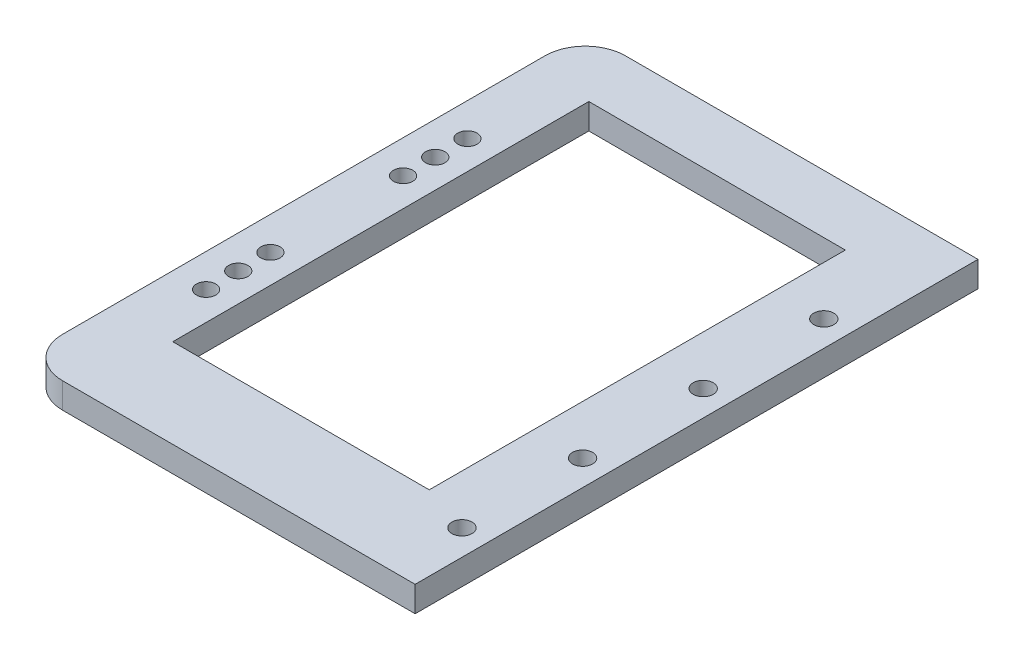
ISO-10303-21;
HEADER;
FILE_DESCRIPTION(('STEP AP214'),'2;1');
FILE_NAME('part.step','',(''),(''),'','','');
FILE_SCHEMA(('AUTOMOTIVE_DESIGN { 1 0 10303 214 1 1 1 1 }'));
ENDSEC;
DATA;
#1=APPLICATION_CONTEXT('core data for automotive mechanical design processes');
#2=APPLICATION_PROTOCOL_DEFINITION('international standard','automotive_design',2000,#1);
#3=PRODUCT_CONTEXT('',#1,'mechanical');
#4=PRODUCT('Part','Part','',(#3));
#5=PRODUCT_RELATED_PRODUCT_CATEGORY('part','',(#4));
#6=PRODUCT_DEFINITION_FORMATION('','',#4);
#7=PRODUCT_DEFINITION_CONTEXT('part definition',#1,'design');
#8=PRODUCT_DEFINITION('design','',#6,#7);
#9=PRODUCT_DEFINITION_SHAPE('','',#8);
#10=(LENGTH_UNIT() NAMED_UNIT(*) SI_UNIT(.MILLI.,.METRE.));
#11=(NAMED_UNIT(*) PLANE_ANGLE_UNIT() SI_UNIT($,.RADIAN.));
#12=(NAMED_UNIT(*) SI_UNIT($,.STERADIAN.) SOLID_ANGLE_UNIT());
#13=UNCERTAINTY_MEASURE_WITH_UNIT(LENGTH_MEASURE(1.E-05),#10,'distance_accuracy_value','');
#14=(GEOMETRIC_REPRESENTATION_CONTEXT(3) GLOBAL_UNCERTAINTY_ASSIGNED_CONTEXT((#13)) GLOBAL_UNIT_ASSIGNED_CONTEXT((#10,
#11,#12)) REPRESENTATION_CONTEXT('',''));
#15=CARTESIAN_POINT('',(0.,0.,0.));
#16=DIRECTION('',(0.,0.,1.));
#17=DIRECTION('',(1.,0.,0.));
#18=AXIS2_PLACEMENT_3D('',#15,#16,#17);
#19=CARTESIAN_POINT('',(-44.8562300319489,6.35,-77.8913738019169));
#20=DIRECTION('',(1.,0.,0.));
#21=DIRECTION('',(0.,0.,-1.));
#22=AXIS2_PLACEMENT_3D('',#19,#20,#21);
#23=PLANE('',#22);
#24=DIRECTION('',(0.,0.,1.));
#25=VECTOR('',#24,1.);
#26=CARTESIAN_POINT('',(-44.8562300319489,0.,-77.8913738019169));
#27=LINE('',#26,#25);
#28=CARTESIAN_POINT('',(-44.8562300319489,0.,-67.8913738019169));
#29=VERTEX_POINT('',#28);
#30=CARTESIAN_POINT('',(-44.8562300319489,0.,52.1086261980831));
#31=VERTEX_POINT('',#30);
#32=EDGE_CURVE('E147',#29,#31,#27,.T.);
#33=ORIENTED_EDGE('',*,*,#32,.T.);
#34=DIRECTION('',(0.,-1.,0.));
#35=VECTOR('',#34,1.);
#36=CARTESIAN_POINT('',(-44.8562300319489,6.35,52.1086261980831));
#37=LINE('',#36,#35);
#38=CARTESIAN_POINT('',(-44.8562300319489,6.35,52.1086261980831));
#39=VERTEX_POINT('',#38);
#40=EDGE_CURVE('E186',#31,#39,#37,.F.);
#41=ORIENTED_EDGE('',*,*,#40,.T.);
#42=DIRECTION('',(0.,0.,1.));
#43=VECTOR('',#42,1.);
#44=CARTESIAN_POINT('',(-44.8562300319489,6.35,-77.8913738019169));
#45=LINE('',#44,#43);
#46=CARTESIAN_POINT('',(-44.8562300319489,6.35,-67.8913738019169));
#47=VERTEX_POINT('',#46);
#48=EDGE_CURVE('E151',#47,#39,#45,.T.);
#49=ORIENTED_EDGE('',*,*,#48,.F.);
#50=DIRECTION('',(0.,-1.,0.));
#51=VECTOR('',#50,1.);
#52=CARTESIAN_POINT('',(-44.8562300319489,6.35,-67.8913738019169));
#53=LINE('',#52,#51);
#54=EDGE_CURVE('E183',#47,#29,#53,.T.);
#55=ORIENTED_EDGE('',*,*,#54,.T.);
#56=EDGE_LOOP('',(#33,#41,#49,#55));
#57=FACE_BOUND('',#56,.T.);
#58=ADVANCED_FACE('F32',(#57),#23,.F.);
#59=CARTESIAN_POINT('',(-44.8562300319489,6.35,62.1086261980831));
#60=DIRECTION('',(0.,0.,-1.));
#61=DIRECTION('',(-1.,0.,0.));
#62=AXIS2_PLACEMENT_3D('',#59,#60,#61);
#63=PLANE('',#62);
#64=DIRECTION('',(1.,0.,0.));
#65=VECTOR('',#64,1.);
#66=CARTESIAN_POINT('',(-44.8562300319489,6.35,62.1086261980831));
#67=LINE('',#66,#65);
#68=CARTESIAN_POINT('',(-34.8562300319489,6.35,62.1086261980831));
#69=VERTEX_POINT('',#68);
#70=CARTESIAN_POINT('',(52.8437699680511,6.35,62.1086261980831));
#71=VERTEX_POINT('',#70);
#72=EDGE_CURVE('E154',#69,#71,#67,.T.);
#73=ORIENTED_EDGE('',*,*,#72,.F.);
#74=DIRECTION('',(0.,-1.,0.));
#75=VECTOR('',#74,1.);
#76=CARTESIAN_POINT('',(-34.8562300319489,6.35,62.1086261980831));
#77=LINE('',#76,#75);
#78=CARTESIAN_POINT('',(-34.8562300319489,0.,62.1086261980831));
#79=VERTEX_POINT('',#78);
#80=EDGE_CURVE('E176',#69,#79,#77,.T.);
#81=ORIENTED_EDGE('',*,*,#80,.T.);
#82=DIRECTION('',(1.,0.,0.));
#83=VECTOR('',#82,1.);
#84=CARTESIAN_POINT('',(-44.8562300319489,0.,62.1086261980831));
#85=LINE('',#84,#83);
#86=CARTESIAN_POINT('',(52.8437699680511,0.,62.1086261980831));
#87=VERTEX_POINT('',#86);
#88=EDGE_CURVE('E165',#79,#87,#85,.T.);
#89=ORIENTED_EDGE('',*,*,#88,.T.);
#90=DIRECTION('',(0.,-1.,0.));
#91=VECTOR('',#90,1.);
#92=CARTESIAN_POINT('',(52.8437699680511,6.35,62.1086261980831));
#93=LINE('',#92,#91);
#94=EDGE_CURVE('E173',#71,#87,#93,.T.);
#95=ORIENTED_EDGE('',*,*,#94,.F.);
#96=EDGE_LOOP('',(#73,#81,#89,#95));
#97=FACE_BOUND('',#96,.T.);
#98=ADVANCED_FACE('F260',(#97),#63,.F.);
#99=CARTESIAN_POINT('',(52.8437699680511,6.35,-77.8913738019169));
#100=DIRECTION('',(-1.,0.,0.));
#101=DIRECTION('',(0.,0.,1.));
#102=AXIS2_PLACEMENT_3D('',#99,#100,#101);
#103=PLANE('',#102);
#104=DIRECTION('',(0.,0.,-1.));
#105=VECTOR('',#104,1.);
#106=CARTESIAN_POINT('',(52.8437699680511,0.,-77.8913738019169));
#107=LINE('',#106,#105);
#108=CARTESIAN_POINT('',(52.8437699680511,0.,-77.8913738019169));
#109=VERTEX_POINT('',#108);
#110=EDGE_CURVE('E167',#87,#109,#107,.T.);
#111=ORIENTED_EDGE('',*,*,#110,.T.);
#112=DIRECTION('',(0.,-1.,0.));
#113=VECTOR('',#112,1.);
#114=CARTESIAN_POINT('',(52.8437699680511,6.35,-77.8913738019169));
#115=LINE('',#114,#113);
#116=CARTESIAN_POINT('',(52.8437699680511,6.35,-77.8913738019169));
#117=VERTEX_POINT('',#116);
#118=EDGE_CURVE('E162',#117,#109,#115,.T.);
#119=ORIENTED_EDGE('',*,*,#118,.F.);
#120=DIRECTION('',(0.,0.,-1.));
#121=VECTOR('',#120,1.);
#122=CARTESIAN_POINT('',(52.8437699680511,6.35,-77.8913738019169));
#123=LINE('',#122,#121);
#124=EDGE_CURVE('E157',#71,#117,#123,.T.);
#125=ORIENTED_EDGE('',*,*,#124,.F.);
#126=ORIENTED_EDGE('',*,*,#94,.T.);
#127=EDGE_LOOP('',(#111,#119,#125,#126));
#128=FACE_BOUND('',#127,.T.);
#129=ADVANCED_FACE('F267',(#128),#103,.F.);
#130=CARTESIAN_POINT('',(-44.8562300319489,6.35,-77.8913738019169));
#131=DIRECTION('',(0.,0.,1.));
#132=DIRECTION('',(1.,0.,0.));
#133=AXIS2_PLACEMENT_3D('',#130,#131,#132);
#134=PLANE('',#133);
#135=DIRECTION('',(-1.,0.,0.));
#136=VECTOR('',#135,1.);
#137=CARTESIAN_POINT('',(-44.8562300319489,0.,-77.8913738019169));
#138=LINE('',#137,#136);
#139=CARTESIAN_POINT('',(-34.8562300319489,0.,-77.8913738019169));
#140=VERTEX_POINT('',#139);
#141=EDGE_CURVE('E155',#109,#140,#138,.T.);
#142=ORIENTED_EDGE('',*,*,#141,.T.);
#143=DIRECTION('',(0.,-1.,0.));
#144=VECTOR('',#143,1.);
#145=CARTESIAN_POINT('',(-34.8562300319489,6.35,-77.8913738019169));
#146=LINE('',#145,#144);
#147=CARTESIAN_POINT('',(-34.8562300319489,6.35,-77.8913738019169));
#148=VERTEX_POINT('',#147);
#149=EDGE_CURVE('E11',#140,#148,#146,.F.);
#150=ORIENTED_EDGE('',*,*,#149,.T.);
#151=DIRECTION('',(-1.,0.,0.));
#152=VECTOR('',#151,1.);
#153=CARTESIAN_POINT('',(-44.8562300319489,6.35,-77.8913738019169));
#154=LINE('',#153,#152);
#155=EDGE_CURVE('E159',#117,#148,#154,.T.);
#156=ORIENTED_EDGE('',*,*,#155,.F.);
#157=ORIENTED_EDGE('',*,*,#118,.T.);
#158=EDGE_LOOP('',(#142,#150,#156,#157));
#159=FACE_BOUND('',#158,.T.);
#160=ADVANCED_FACE('F243',(#159),#134,.F.);
#161=CARTESIAN_POINT('',(0.,6.35,0.));
#162=DIRECTION('',(0.,1.,0.));
#163=DIRECTION('',(0.,0.,1.));
#164=AXIS2_PLACEMENT_3D('',#161,#162,#163);
#165=PLANE('',#164);
#166=CARTESIAN_POINT('',(46.4937699680511,6.35,-45.8881315347984));
#167=DIRECTION('',(0.,1.,0.));
#168=DIRECTION('',(0.,0.,1.));
#169=AXIS2_PLACEMENT_3D('',#166,#167,#168);
#170=CIRCLE('',#169,2.49999999999999);
#171=CARTESIAN_POINT('',(46.4937699680511,6.35,-43.3881315347984));
#172=VERTEX_POINT('',#171);
#173=EDGE_CURVE('E488',#172,#172,#170,.T.);
#174=ORIENTED_EDGE('',*,*,#173,.F.);
#175=EDGE_LOOP('',(#174));
#176=FACE_BOUND('',#175,.T.);
#177=CARTESIAN_POINT('',(46.4937699680514,6.35,-15.8881315347984));
#178=DIRECTION('',(0.,1.,0.));
#179=DIRECTION('',(0.,0.,1.));
#180=AXIS2_PLACEMENT_3D('',#177,#178,#179);
#181=CIRCLE('',#180,2.49999999999999);
#182=CARTESIAN_POINT('',(46.4937699680514,6.35,-13.3881315347984));
#183=VERTEX_POINT('',#182);
#184=EDGE_CURVE('E491',#183,#183,#181,.T.);
#185=ORIENTED_EDGE('',*,*,#184,.F.);
#186=EDGE_LOOP('',(#185));
#187=FACE_BOUND('',#186,.T.);
#188=CARTESIAN_POINT('',(46.4937699680518,6.35,14.1118684652016));
#189=DIRECTION('',(0.,1.,0.));
#190=DIRECTION('',(0.,0.,1.));
#191=AXIS2_PLACEMENT_3D('',#188,#189,#190);
#192=CIRCLE('',#191,2.49999999999999);
#193=CARTESIAN_POINT('',(46.4937699680518,6.35,16.6118684652016));
#194=VERTEX_POINT('',#193);
#195=EDGE_CURVE('E203',#194,#194,#192,.T.);
#196=ORIENTED_EDGE('',*,*,#195,.F.);
#197=EDGE_LOOP('',(#196));
#198=FACE_BOUND('',#197,.T.);
#199=CARTESIAN_POINT('',(46.4937699680521,6.35,44.1118684652016));
#200=DIRECTION('',(0.,1.,0.));
#201=DIRECTION('',(0.,0.,1.));
#202=AXIS2_PLACEMENT_3D('',#199,#200,#201);
#203=CIRCLE('',#202,2.49999999999999);
#204=CARTESIAN_POINT('',(46.4937699680521,6.35,46.6118684652016));
#205=VERTEX_POINT('',#204);
#206=EDGE_CURVE('E192',#205,#205,#203,.T.);
#207=ORIENTED_EDGE('',*,*,#206,.F.);
#208=EDGE_LOOP('',(#207));
#209=FACE_BOUND('',#208,.T.);
#210=CARTESIAN_POINT('',(-36.656230031949,6.35,-40.3913738019169));
#211=DIRECTION('',(0.,1.,0.));
#212=DIRECTION('',(0.,0.,1.));
#213=AXIS2_PLACEMENT_3D('',#210,#211,#212);
#214=CIRCLE('',#213,2.4);
#215=CARTESIAN_POINT('',(-36.656230031949,6.35,-37.9913738019169));
#216=VERTEX_POINT('',#215);
#217=EDGE_CURVE('E209',#216,#216,#214,.T.);
#218=ORIENTED_EDGE('',*,*,#217,.F.);
#219=EDGE_LOOP('',(#218));
#220=FACE_BOUND('',#219,.T.);
#221=CARTESIAN_POINT('',(-36.6562300319489,6.35,-24.3913738019169));
#222=DIRECTION('',(0.,1.,0.));
#223=DIRECTION('',(0.,0.,1.));
#224=AXIS2_PLACEMENT_3D('',#221,#222,#223);
#225=CIRCLE('',#224,2.4);
#226=CARTESIAN_POINT('',(-36.6562300319489,6.35,-21.9913738019169));
#227=VERTEX_POINT('',#226);
#228=EDGE_CURVE('E212',#227,#227,#225,.T.);
#229=ORIENTED_EDGE('',*,*,#228,.F.);
#230=EDGE_LOOP('',(#229));
#231=FACE_BOUND('',#230,.T.);
#232=CARTESIAN_POINT('',(-36.656230031949,6.35,8.60862619808315));
#233=DIRECTION('',(0.,1.,0.));
#234=DIRECTION('',(0.,0.,1.));
#235=AXIS2_PLACEMENT_3D('',#232,#233,#234);
#236=CIRCLE('',#235,2.4);
#237=CARTESIAN_POINT('',(-36.656230031949,6.35,11.0086261980832));
#238=VERTEX_POINT('',#237);
#239=EDGE_CURVE('E218',#238,#238,#236,.T.);
#240=ORIENTED_EDGE('',*,*,#239,.F.);
#241=EDGE_LOOP('',(#240));
#242=FACE_BOUND('',#241,.T.);
#243=CARTESIAN_POINT('',(-36.6562300319489,6.35,24.6086261980831));
#244=DIRECTION('',(0.,1.,0.));
#245=DIRECTION('',(0.,0.,1.));
#246=AXIS2_PLACEMENT_3D('',#243,#244,#245);
#247=CIRCLE('',#246,2.4);
#248=CARTESIAN_POINT('',(-36.6562300319489,6.35,27.0086261980831));
#249=VERTEX_POINT('',#248);
#250=EDGE_CURVE('E224',#249,#249,#247,.T.);
#251=ORIENTED_EDGE('',*,*,#250,.F.);
#252=EDGE_LOOP('',(#251));
#253=FACE_BOUND('',#252,.T.);
#254=CARTESIAN_POINT('',(-36.656230031949,6.35,16.6086261980832));
#255=DIRECTION('',(0.,1.,0.));
#256=DIRECTION('',(0.,0.,1.));
#257=AXIS2_PLACEMENT_3D('',#254,#255,#256);
#258=CIRCLE('',#257,2.4);
#259=CARTESIAN_POINT('',(-36.656230031949,6.35,19.0086261980832));
#260=VERTEX_POINT('',#259);
#261=EDGE_CURVE('E230',#260,#260,#258,.T.);
#262=ORIENTED_EDGE('',*,*,#261,.F.);
#263=EDGE_LOOP('',(#262));
#264=FACE_BOUND('',#263,.T.);
#265=CARTESIAN_POINT('',(-36.656230031949,6.35,-32.3913738019169));
#266=DIRECTION('',(0.,1.,0.));
#267=DIRECTION('',(0.,0.,1.));
#268=AXIS2_PLACEMENT_3D('',#265,#266,#267);
#269=CIRCLE('',#268,2.4);
#270=CARTESIAN_POINT('',(-36.656230031949,6.35,-29.9913738019169));
#271=VERTEX_POINT('',#270);
#272=EDGE_CURVE('E196',#271,#271,#269,.T.);
#273=ORIENTED_EDGE('',*,*,#272,.F.);
#274=EDGE_LOOP('',(#273));
#275=FACE_BOUND('',#274,.T.);
#276=DIRECTION('',(-0.999998775475468,0.,-0.00156494331060306));
#277=VECTOR('',#276,1.);
#278=CARTESIAN_POINT('',(34.3437699680511,6.35,-63.3913738019169));
#279=LINE('',#278,#277);
#280=CARTESIAN_POINT('',(34.3437699680511,6.35,-63.3913738019169));
#281=VERTEX_POINT('',#280);
#282=CARTESIAN_POINT('',(-29.5562300319489,6.35,-63.4913738019169));
#283=VERTEX_POINT('',#282);
#284=EDGE_CURVE('E49',#281,#283,#279,.T.);
#285=ORIENTED_EDGE('',*,*,#284,.F.);
#286=DIRECTION('',(0.00096719822504667,0.,-0.999999532263687));
#287=VECTOR('',#286,1.);
#288=CARTESIAN_POINT('',(34.2437699680511,6.35,40.));
#289=LINE('',#288,#287);
#290=CARTESIAN_POINT('',(34.2437699680511,6.35,40.));
#291=VERTEX_POINT('',#290);
#292=EDGE_CURVE('E128',#291,#281,#289,.T.);
#293=ORIENTED_EDGE('',*,*,#292,.F.);
#294=DIRECTION('',(1.,0.,0.));
#295=VECTOR('',#294,1.);
#296=CARTESIAN_POINT('',(-29.5562300319489,6.35,40.));
#297=LINE('',#296,#295);
#298=CARTESIAN_POINT('',(-29.5562300319489,6.35,40.));
#299=VERTEX_POINT('',#298);
#300=EDGE_CURVE('E131',#299,#291,#297,.T.);
#301=ORIENTED_EDGE('',*,*,#300,.F.);
#302=DIRECTION('',(0.,0.,1.));
#303=VECTOR('',#302,1.);
#304=CARTESIAN_POINT('',(-29.5562300319489,6.35,-63.4913738019169));
#305=LINE('',#304,#303);
#306=EDGE_CURVE('E140',#283,#299,#305,.T.);
#307=ORIENTED_EDGE('',*,*,#306,.F.);
#308=EDGE_LOOP('',(#285,#293,#301,#307));
#309=FACE_BOUND('',#308,.T.);
#310=ORIENTED_EDGE('',*,*,#48,.T.);
#311=CARTESIAN_POINT('',(-34.8562300319489,6.35,52.1086261980831));
#312=DIRECTION('',(0.,1.,0.));
#313=DIRECTION('',(0.,0.,1.));
#314=AXIS2_PLACEMENT_3D('',#311,#312,#313);
#315=CIRCLE('',#314,10.);
#316=EDGE_CURVE('E41',#39,#69,#315,.T.);
#317=ORIENTED_EDGE('',*,*,#316,.T.);
#318=ORIENTED_EDGE('',*,*,#72,.T.);
#319=ORIENTED_EDGE('',*,*,#124,.T.);
#320=ORIENTED_EDGE('',*,*,#155,.T.);
#321=CARTESIAN_POINT('',(-34.8562300319489,6.35,-67.8913738019169));
#322=DIRECTION('',(0.,1.,0.));
#323=DIRECTION('',(0.,0.,1.));
#324=AXIS2_PLACEMENT_3D('',#321,#322,#323);
#325=CIRCLE('',#324,10.);
#326=EDGE_CURVE('E188',#148,#47,#325,.T.);
#327=ORIENTED_EDGE('',*,*,#326,.T.);
#328=EDGE_LOOP('',(#310,#317,#318,#319,#320,#327));
#329=FACE_BOUND('',#328,.T.);
#330=ADVANCED_FACE('F240',(#176,#187,#198,#209,#220,#231,#242,#253,#264,#275,#309,#329),#165,.T.);
#331=CARTESIAN_POINT('',(0.,0.,0.));
#332=DIRECTION('',(0.,1.,0.));
#333=DIRECTION('',(0.,0.,1.));
#334=AXIS2_PLACEMENT_3D('',#331,#332,#333);
#335=PLANE('',#334);
#336=CARTESIAN_POINT('',(46.4937699680511,0.,-45.8881315347984));
#337=DIRECTION('',(0.,1.,0.));
#338=DIRECTION('',(0.,0.,1.));
#339=AXIS2_PLACEMENT_3D('',#336,#337,#338);
#340=CIRCLE('',#339,2.49999999999999);
#341=CARTESIAN_POINT('',(46.4937699680511,0.,-43.3881315347984));
#342=VERTEX_POINT('',#341);
#343=EDGE_CURVE('E490',#342,#342,#340,.T.);
#344=ORIENTED_EDGE('',*,*,#343,.T.);
#345=EDGE_LOOP('',(#344));
#346=FACE_BOUND('',#345,.T.);
#347=CARTESIAN_POINT('',(46.4937699680514,0.,-15.8881315347984));
#348=DIRECTION('',(0.,1.,0.));
#349=DIRECTION('',(0.,0.,1.));
#350=AXIS2_PLACEMENT_3D('',#347,#348,#349);
#351=CIRCLE('',#350,2.49999999999999);
#352=CARTESIAN_POINT('',(46.4937699680514,0.,-13.3881315347984));
#353=VERTEX_POINT('',#352);
#354=EDGE_CURVE('E36',#353,#353,#351,.T.);
#355=ORIENTED_EDGE('',*,*,#354,.T.);
#356=EDGE_LOOP('',(#355));
#357=FACE_BOUND('',#356,.T.);
#358=CARTESIAN_POINT('',(46.4937699680518,0.,14.1118684652016));
#359=DIRECTION('',(0.,1.,0.));
#360=DIRECTION('',(0.,0.,1.));
#361=AXIS2_PLACEMENT_3D('',#358,#359,#360);
#362=CIRCLE('',#361,2.49999999999999);
#363=CARTESIAN_POINT('',(46.4937699680518,0.,16.6118684652016));
#364=VERTEX_POINT('',#363);
#365=EDGE_CURVE('E198',#364,#364,#362,.T.);
#366=ORIENTED_EDGE('',*,*,#365,.T.);
#367=EDGE_LOOP('',(#366));
#368=FACE_BOUND('',#367,.T.);
#369=CARTESIAN_POINT('',(46.4937699680521,0.,44.1118684652016));
#370=DIRECTION('',(0.,1.,0.));
#371=DIRECTION('',(0.,0.,1.));
#372=AXIS2_PLACEMENT_3D('',#369,#370,#371);
#373=CIRCLE('',#372,2.49999999999999);
#374=CARTESIAN_POINT('',(46.4937699680521,0.,46.6118684652016));
#375=VERTEX_POINT('',#374);
#376=EDGE_CURVE('E190',#375,#375,#373,.T.);
#377=ORIENTED_EDGE('',*,*,#376,.T.);
#378=EDGE_LOOP('',(#377));
#379=FACE_BOUND('',#378,.T.);
#380=CARTESIAN_POINT('',(-36.656230031949,0.,-40.3913738019169));
#381=DIRECTION('',(0.,1.,0.));
#382=DIRECTION('',(0.,0.,1.));
#383=AXIS2_PLACEMENT_3D('',#380,#381,#382);
#384=CIRCLE('',#383,2.4);
#385=CARTESIAN_POINT('',(-36.656230031949,0.,-37.9913738019169));
#386=VERTEX_POINT('',#385);
#387=EDGE_CURVE('E141',#386,#386,#384,.T.);
#388=ORIENTED_EDGE('',*,*,#387,.T.);
#389=EDGE_LOOP('',(#388));
#390=FACE_BOUND('',#389,.T.);
#391=CARTESIAN_POINT('',(-36.6562300319489,0.,-24.3913738019169));
#392=DIRECTION('',(0.,1.,0.));
#393=DIRECTION('',(0.,0.,1.));
#394=AXIS2_PLACEMENT_3D('',#391,#392,#393);
#395=CIRCLE('',#394,2.4);
#396=CARTESIAN_POINT('',(-36.6562300319489,0.,-21.9913738019169));
#397=VERTEX_POINT('',#396);
#398=EDGE_CURVE('E215',#397,#397,#395,.T.);
#399=ORIENTED_EDGE('',*,*,#398,.T.);
#400=EDGE_LOOP('',(#399));
#401=FACE_BOUND('',#400,.T.);
#402=CARTESIAN_POINT('',(-36.656230031949,0.,8.60862619808315));
#403=DIRECTION('',(0.,1.,0.));
#404=DIRECTION('',(0.,0.,1.));
#405=AXIS2_PLACEMENT_3D('',#402,#403,#404);
#406=CIRCLE('',#405,2.4);
#407=CARTESIAN_POINT('',(-36.656230031949,0.,11.0086261980832));
#408=VERTEX_POINT('',#407);
#409=EDGE_CURVE('E221',#408,#408,#406,.T.);
#410=ORIENTED_EDGE('',*,*,#409,.T.);
#411=EDGE_LOOP('',(#410));
#412=FACE_BOUND('',#411,.T.);
#413=CARTESIAN_POINT('',(-36.6562300319489,0.,24.6086261980831));
#414=DIRECTION('',(0.,1.,0.));
#415=DIRECTION('',(0.,0.,1.));
#416=AXIS2_PLACEMENT_3D('',#413,#414,#415);
#417=CIRCLE('',#416,2.4);
#418=CARTESIAN_POINT('',(-36.6562300319489,0.,27.0086261980831));
#419=VERTEX_POINT('',#418);
#420=EDGE_CURVE('E227',#419,#419,#417,.T.);
#421=ORIENTED_EDGE('',*,*,#420,.T.);
#422=EDGE_LOOP('',(#421));
#423=FACE_BOUND('',#422,.T.);
#424=CARTESIAN_POINT('',(-36.656230031949,0.,16.6086261980832));
#425=DIRECTION('',(0.,1.,0.));
#426=DIRECTION('',(0.,0.,1.));
#427=AXIS2_PLACEMENT_3D('',#424,#425,#426);
#428=CIRCLE('',#427,2.4);
#429=CARTESIAN_POINT('',(-36.656230031949,0.,19.0086261980832));
#430=VERTEX_POINT('',#429);
#431=EDGE_CURVE('E233',#430,#430,#428,.T.);
#432=ORIENTED_EDGE('',*,*,#431,.T.);
#433=EDGE_LOOP('',(#432));
#434=FACE_BOUND('',#433,.T.);
#435=CARTESIAN_POINT('',(-36.656230031949,0.,-32.3913738019169));
#436=DIRECTION('',(0.,1.,0.));
#437=DIRECTION('',(0.,0.,1.));
#438=AXIS2_PLACEMENT_3D('',#435,#436,#437);
#439=CIRCLE('',#438,2.4);
#440=CARTESIAN_POINT('',(-36.656230031949,0.,-29.9913738019169));
#441=VERTEX_POINT('',#440);
#442=EDGE_CURVE('E134',#441,#441,#439,.T.);
#443=ORIENTED_EDGE('',*,*,#442,.T.);
#444=EDGE_LOOP('',(#443));
#445=FACE_BOUND('',#444,.T.);
#446=DIRECTION('',(0.00096719822504667,0.,-0.999999532263687));
#447=VECTOR('',#446,1.);
#448=CARTESIAN_POINT('',(34.2437699680511,0.,40.));
#449=LINE('',#448,#447);
#450=CARTESIAN_POINT('',(34.2437699680511,0.,40.));
#451=VERTEX_POINT('',#450);
#452=CARTESIAN_POINT('',(34.3437699680511,0.,-63.3913738019169));
#453=VERTEX_POINT('',#452);
#454=EDGE_CURVE('E118',#451,#453,#449,.T.);
#455=ORIENTED_EDGE('',*,*,#454,.T.);
#456=DIRECTION('',(-0.999998775475468,0.,-0.00156494331060306));
#457=VECTOR('',#456,1.);
#458=CARTESIAN_POINT('',(34.3437699680511,0.,-63.3913738019169));
#459=LINE('',#458,#457);
#460=CARTESIAN_POINT('',(-29.5562300319489,0.,-63.4913738019169));
#461=VERTEX_POINT('',#460);
#462=EDGE_CURVE('E112',#453,#461,#459,.T.);
#463=ORIENTED_EDGE('',*,*,#462,.T.);
#464=DIRECTION('',(0.,0.,1.));
#465=VECTOR('',#464,1.);
#466=CARTESIAN_POINT('',(-29.5562300319489,0.,-63.4913738019169));
#467=LINE('',#466,#465);
#468=CARTESIAN_POINT('',(-29.5562300319489,0.,40.));
#469=VERTEX_POINT('',#468);
#470=EDGE_CURVE('E121',#461,#469,#467,.T.);
#471=ORIENTED_EDGE('',*,*,#470,.T.);
#472=DIRECTION('',(1.,0.,0.));
#473=VECTOR('',#472,1.);
#474=CARTESIAN_POINT('',(-29.5562300319489,0.,40.));
#475=LINE('',#474,#473);
#476=EDGE_CURVE('E57',#469,#451,#475,.T.);
#477=ORIENTED_EDGE('',*,*,#476,.T.);
#478=EDGE_LOOP('',(#455,#463,#471,#477));
#479=FACE_BOUND('',#478,.T.);
#480=ORIENTED_EDGE('',*,*,#88,.F.);
#481=CARTESIAN_POINT('',(-34.8562300319489,0.,52.1086261980831));
#482=DIRECTION('',(0.,1.,0.));
#483=DIRECTION('',(0.,0.,1.));
#484=AXIS2_PLACEMENT_3D('',#481,#482,#483);
#485=CIRCLE('',#484,10.);
#486=EDGE_CURVE('E181',#79,#31,#485,.F.);
#487=ORIENTED_EDGE('',*,*,#486,.T.);
#488=ORIENTED_EDGE('',*,*,#32,.F.);
#489=CARTESIAN_POINT('',(-34.8562300319489,0.,-67.8913738019169));
#490=DIRECTION('',(0.,1.,0.));
#491=DIRECTION('',(0.,0.,1.));
#492=AXIS2_PLACEMENT_3D('',#489,#490,#491);
#493=CIRCLE('',#492,10.);
#494=EDGE_CURVE('E179',#29,#140,#493,.F.);
#495=ORIENTED_EDGE('',*,*,#494,.T.);
#496=ORIENTED_EDGE('',*,*,#141,.F.);
#497=ORIENTED_EDGE('',*,*,#110,.F.);
#498=EDGE_LOOP('',(#480,#487,#488,#495,#496,#497));
#499=FACE_BOUND('',#498,.T.);
#500=ADVANCED_FACE('F125',(#346,#357,#368,#379,#390,#401,#412,#423,#434,#445,#479,#499),#335,.F.);
#501=CARTESIAN_POINT('',(-34.8562300319489,6.35,52.1086261980831));
#502=DIRECTION('',(0.,-1.,0.));
#503=DIRECTION('',(0.,0.,-1.));
#504=AXIS2_PLACEMENT_3D('',#501,#502,#503);
#505=CYLINDRICAL_SURFACE('',#504,10.);
#506=ORIENTED_EDGE('',*,*,#316,.F.);
#507=ORIENTED_EDGE('',*,*,#40,.F.);
#508=ORIENTED_EDGE('',*,*,#486,.F.);
#509=ORIENTED_EDGE('',*,*,#80,.F.);
#510=EDGE_LOOP('',(#506,#507,#508,#509));
#511=FACE_BOUND('',#510,.T.);
#512=ADVANCED_FACE('F257',(#511),#505,.T.);
#513=CARTESIAN_POINT('',(-34.8562300319489,6.35,-67.8913738019169));
#514=DIRECTION('',(0.,-1.,0.));
#515=DIRECTION('',(0.,0.,-1.));
#516=AXIS2_PLACEMENT_3D('',#513,#514,#515);
#517=CYLINDRICAL_SURFACE('',#516,10.);
#518=ORIENTED_EDGE('',*,*,#326,.F.);
#519=ORIENTED_EDGE('',*,*,#149,.F.);
#520=ORIENTED_EDGE('',*,*,#494,.F.);
#521=ORIENTED_EDGE('',*,*,#54,.F.);
#522=EDGE_LOOP('',(#518,#519,#520,#521));
#523=FACE_BOUND('',#522,.T.);
#524=ADVANCED_FACE('F34',(#523),#517,.T.);
#525=CARTESIAN_POINT('',(34.3437699680511,0.,-63.3913738019169));
#526=DIRECTION('',(0.00156494331060306,0.,-0.999998775475467));
#527=DIRECTION('',(-0.999998775475468,0.,-0.00156494331060306));
#528=AXIS2_PLACEMENT_3D('',#525,#526,#527);
#529=PLANE('',#528);
#530=ORIENTED_EDGE('',*,*,#284,.T.);
#531=DIRECTION('',(0.,1.,0.));
#532=VECTOR('',#531,1.);
#533=CARTESIAN_POINT('',(-29.5562300319489,0.,-63.4913738019169));
#534=LINE('',#533,#532);
#535=EDGE_CURVE('E108',#461,#283,#534,.T.);
#536=ORIENTED_EDGE('',*,*,#535,.F.);
#537=ORIENTED_EDGE('',*,*,#462,.F.);
#538=DIRECTION('',(0.,1.,0.));
#539=VECTOR('',#538,1.);
#540=CARTESIAN_POINT('',(34.3437699680511,0.,-63.3913738019169));
#541=LINE('',#540,#539);
#542=EDGE_CURVE('E145',#453,#281,#541,.T.);
#543=ORIENTED_EDGE('',*,*,#542,.T.);
#544=EDGE_LOOP('',(#530,#536,#537,#543));
#545=FACE_BOUND('',#544,.T.);
#546=ADVANCED_FACE('F110',(#545),#529,.F.);
#547=CARTESIAN_POINT('',(34.2437699680511,0.,40.));
#548=DIRECTION('',(0.999999532263687,0.,0.00096719822504667));
#549=DIRECTION('',(0.00096719822504667,0.,-0.999999532263687));
#550=AXIS2_PLACEMENT_3D('',#547,#548,#549);
#551=PLANE('',#550);
#552=ORIENTED_EDGE('',*,*,#292,.T.);
#553=ORIENTED_EDGE('',*,*,#542,.F.);
#554=ORIENTED_EDGE('',*,*,#454,.F.);
#555=DIRECTION('',(0.,1.,0.));
#556=VECTOR('',#555,1.);
#557=CARTESIAN_POINT('',(34.2437699680511,0.,40.));
#558=LINE('',#557,#556);
#559=EDGE_CURVE('E148',#451,#291,#558,.T.);
#560=ORIENTED_EDGE('',*,*,#559,.T.);
#561=EDGE_LOOP('',(#552,#553,#554,#560));
#562=FACE_BOUND('',#561,.T.);
#563=ADVANCED_FACE('F385',(#562),#551,.F.);
#564=CARTESIAN_POINT('',(-29.5562300319489,0.,40.));
#565=DIRECTION('',(0.,0.,1.));
#566=DIRECTION('',(1.,0.,0.));
#567=AXIS2_PLACEMENT_3D('',#564,#565,#566);
#568=PLANE('',#567);
#569=ORIENTED_EDGE('',*,*,#300,.T.);
#570=ORIENTED_EDGE('',*,*,#559,.F.);
#571=ORIENTED_EDGE('',*,*,#476,.F.);
#572=DIRECTION('',(0.,1.,0.));
#573=VECTOR('',#572,1.);
#574=CARTESIAN_POINT('',(-29.5562300319489,0.,40.));
#575=LINE('',#574,#573);
#576=EDGE_CURVE('E117',#469,#299,#575,.T.);
#577=ORIENTED_EDGE('',*,*,#576,.T.);
#578=EDGE_LOOP('',(#569,#570,#571,#577));
#579=FACE_BOUND('',#578,.T.);
#580=ADVANCED_FACE('F388',(#579),#568,.F.);
#581=CARTESIAN_POINT('',(-29.5562300319489,0.,-63.4913738019169));
#582=DIRECTION('',(-1.,0.,0.));
#583=DIRECTION('',(0.,0.,1.));
#584=AXIS2_PLACEMENT_3D('',#581,#582,#583);
#585=PLANE('',#584);
#586=ORIENTED_EDGE('',*,*,#306,.T.);
#587=ORIENTED_EDGE('',*,*,#576,.F.);
#588=ORIENTED_EDGE('',*,*,#470,.F.);
#589=ORIENTED_EDGE('',*,*,#535,.T.);
#590=EDGE_LOOP('',(#586,#587,#588,#589));
#591=FACE_BOUND('',#590,.T.);
#592=ADVANCED_FACE('F122',(#591),#585,.F.);
#593=CARTESIAN_POINT('',(-36.656230031949,0.,-32.3913738019169));
#594=DIRECTION('',(0.,1.,0.));
#595=DIRECTION('',(0.,0.,1.));
#596=AXIS2_PLACEMENT_3D('',#593,#594,#595);
#597=CYLINDRICAL_SURFACE('',#596,2.4);
#598=ORIENTED_EDGE('',*,*,#442,.F.);
#599=EDGE_LOOP('',(#598));
#600=FACE_BOUND('',#599,.T.);
#601=ORIENTED_EDGE('',*,*,#272,.T.);
#602=EDGE_LOOP('',(#601));
#603=FACE_BOUND('',#602,.T.);
#604=ADVANCED_FACE('F238',(#600,#603),#597,.F.);
#605=CARTESIAN_POINT('',(-36.656230031949,0.,16.6086261980832));
#606=DIRECTION('',(0.,1.,0.));
#607=DIRECTION('',(0.,0.,1.));
#608=AXIS2_PLACEMENT_3D('',#605,#606,#607);
#609=CYLINDRICAL_SURFACE('',#608,2.4);
#610=ORIENTED_EDGE('',*,*,#431,.F.);
#611=EDGE_LOOP('',(#610));
#612=FACE_BOUND('',#611,.T.);
#613=ORIENTED_EDGE('',*,*,#261,.T.);
#614=EDGE_LOOP('',(#613));
#615=FACE_BOUND('',#614,.T.);
#616=ADVANCED_FACE('F377',(#612,#615),#609,.F.);
#617=CARTESIAN_POINT('',(-36.6562300319489,0.,24.6086261980831));
#618=DIRECTION('',(0.,1.,0.));
#619=DIRECTION('',(0.,0.,1.));
#620=AXIS2_PLACEMENT_3D('',#617,#618,#619);
#621=CYLINDRICAL_SURFACE('',#620,2.4);
#622=ORIENTED_EDGE('',*,*,#420,.F.);
#623=EDGE_LOOP('',(#622));
#624=FACE_BOUND('',#623,.T.);
#625=ORIENTED_EDGE('',*,*,#250,.T.);
#626=EDGE_LOOP('',(#625));
#627=FACE_BOUND('',#626,.T.);
#628=ADVANCED_FACE('F373',(#624,#627),#621,.F.);
#629=CARTESIAN_POINT('',(-36.656230031949,0.,8.60862619808315));
#630=DIRECTION('',(0.,1.,0.));
#631=DIRECTION('',(0.,0.,1.));
#632=AXIS2_PLACEMENT_3D('',#629,#630,#631);
#633=CYLINDRICAL_SURFACE('',#632,2.4);
#634=ORIENTED_EDGE('',*,*,#409,.F.);
#635=EDGE_LOOP('',(#634));
#636=FACE_BOUND('',#635,.T.);
#637=ORIENTED_EDGE('',*,*,#239,.T.);
#638=EDGE_LOOP('',(#637));
#639=FACE_BOUND('',#638,.T.);
#640=ADVANCED_FACE('F369',(#636,#639),#633,.F.);
#641=CARTESIAN_POINT('',(-36.6562300319489,0.,-24.3913738019169));
#642=DIRECTION('',(0.,1.,0.));
#643=DIRECTION('',(0.,0.,1.));
#644=AXIS2_PLACEMENT_3D('',#641,#642,#643);
#645=CYLINDRICAL_SURFACE('',#644,2.4);
#646=ORIENTED_EDGE('',*,*,#398,.F.);
#647=EDGE_LOOP('',(#646));
#648=FACE_BOUND('',#647,.T.);
#649=ORIENTED_EDGE('',*,*,#228,.T.);
#650=EDGE_LOOP('',(#649));
#651=FACE_BOUND('',#650,.T.);
#652=ADVANCED_FACE('F365',(#648,#651),#645,.F.);
#653=CARTESIAN_POINT('',(-36.656230031949,0.,-40.3913738019169));
#654=DIRECTION('',(0.,1.,0.));
#655=DIRECTION('',(0.,0.,1.));
#656=AXIS2_PLACEMENT_3D('',#653,#654,#655);
#657=CYLINDRICAL_SURFACE('',#656,2.4);
#658=ORIENTED_EDGE('',*,*,#387,.F.);
#659=EDGE_LOOP('',(#658));
#660=FACE_BOUND('',#659,.T.);
#661=ORIENTED_EDGE('',*,*,#217,.T.);
#662=EDGE_LOOP('',(#661));
#663=FACE_BOUND('',#662,.T.);
#664=ADVANCED_FACE('F313',(#660,#663),#657,.F.);
#665=CARTESIAN_POINT('',(46.4937699680521,6.35,44.1118684652016));
#666=DIRECTION('',(0.,1.,0.));
#667=DIRECTION('',(0.,0.,1.));
#668=AXIS2_PLACEMENT_3D('',#665,#666,#667);
#669=CYLINDRICAL_SURFACE('',#668,2.49999999999999);
#670=ORIENTED_EDGE('',*,*,#206,.T.);
#671=EDGE_LOOP('',(#670));
#672=FACE_BOUND('',#671,.T.);
#673=ORIENTED_EDGE('',*,*,#376,.F.);
#674=EDGE_LOOP('',(#673));
#675=FACE_BOUND('',#674,.T.);
#676=ADVANCED_FACE('F323',(#672,#675),#669,.F.);
#677=CARTESIAN_POINT('',(46.4937699680518,6.35,14.1118684652016));
#678=DIRECTION('',(0.,1.,0.));
#679=DIRECTION('',(0.,0.,1.));
#680=AXIS2_PLACEMENT_3D('',#677,#678,#679);
#681=CYLINDRICAL_SURFACE('',#680,2.49999999999999);
#682=ORIENTED_EDGE('',*,*,#195,.T.);
#683=EDGE_LOOP('',(#682));
#684=FACE_BOUND('',#683,.T.);
#685=ORIENTED_EDGE('',*,*,#365,.F.);
#686=EDGE_LOOP('',(#685));
#687=FACE_BOUND('',#686,.T.);
#688=ADVANCED_FACE('F328',(#684,#687),#681,.F.);
#689=CARTESIAN_POINT('',(46.4937699680514,6.35,-15.8881315347984));
#690=DIRECTION('',(0.,1.,0.));
#691=DIRECTION('',(0.,0.,1.));
#692=AXIS2_PLACEMENT_3D('',#689,#690,#691);
#693=CYLINDRICAL_SURFACE('',#692,2.49999999999999);
#694=ORIENTED_EDGE('',*,*,#184,.T.);
#695=EDGE_LOOP('',(#694));
#696=FACE_BOUND('',#695,.T.);
#697=ORIENTED_EDGE('',*,*,#354,.F.);
#698=EDGE_LOOP('',(#697));
#699=FACE_BOUND('',#698,.T.);
#700=ADVANCED_FACE('F337',(#696,#699),#693,.F.);
#701=CARTESIAN_POINT('',(46.4937699680511,6.35,-45.8881315347984));
#702=DIRECTION('',(0.,1.,0.));
#703=DIRECTION('',(0.,0.,1.));
#704=AXIS2_PLACEMENT_3D('',#701,#702,#703);
#705=CYLINDRICAL_SURFACE('',#704,2.49999999999999);
#706=ORIENTED_EDGE('',*,*,#173,.T.);
#707=EDGE_LOOP('',(#706));
#708=FACE_BOUND('',#707,.T.);
#709=ORIENTED_EDGE('',*,*,#343,.F.);
#710=EDGE_LOOP('',(#709));
#711=FACE_BOUND('',#710,.T.);
#712=ADVANCED_FACE('F347',(#708,#711),#705,.F.);
#713=CLOSED_SHELL('',(#58,#98,#129,#160,#330,#500,#512,#524,#546,#563,#580,#592,#604,#616,#628,
#640,#652,#664,#676,#688,#700,#712));
#714=MANIFOLD_SOLID_BREP('B2',#713);
#715=ADVANCED_BREP_SHAPE_REPRESENTATION('',(#18,#714),#14);
#716=SHAPE_DEFINITION_REPRESENTATION(#9,#715);
ENDSEC;
END-ISO-10303-21;
